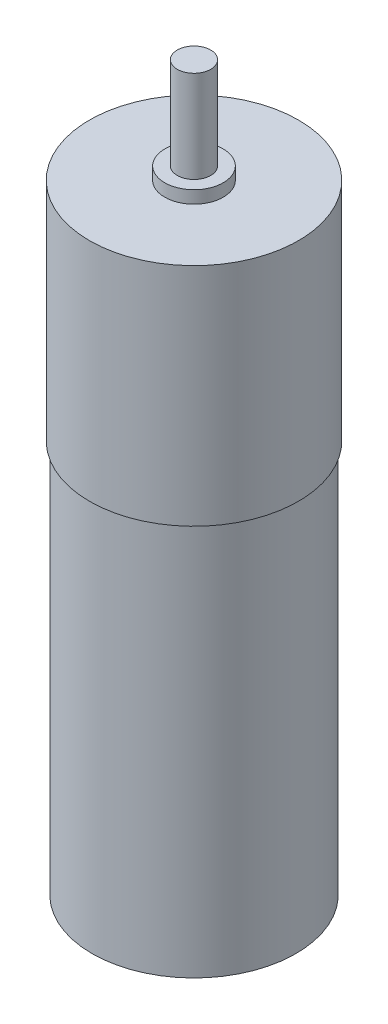
ISO-10303-21;
HEADER;
FILE_DESCRIPTION(('STEP AP214'),'2;1');
FILE_NAME('part.step','',(''),(''),'','','');
FILE_SCHEMA(('AUTOMOTIVE_DESIGN { 1 0 10303 214 1 1 1 1 }'));
ENDSEC;
DATA;
#1=APPLICATION_CONTEXT('core data for automotive mechanical design processes');
#2=APPLICATION_PROTOCOL_DEFINITION('international standard','automotive_design',2000,#1);
#3=PRODUCT_CONTEXT('',#1,'mechanical');
#4=PRODUCT('Part','Part','',(#3));
#5=PRODUCT_RELATED_PRODUCT_CATEGORY('part','',(#4));
#6=PRODUCT_DEFINITION_FORMATION('','',#4);
#7=PRODUCT_DEFINITION_CONTEXT('part definition',#1,'design');
#8=PRODUCT_DEFINITION('design','',#6,#7);
#9=PRODUCT_DEFINITION_SHAPE('','',#8);
#10=(LENGTH_UNIT() NAMED_UNIT(*) SI_UNIT(.MILLI.,.METRE.));
#11=(NAMED_UNIT(*) PLANE_ANGLE_UNIT() SI_UNIT($,.RADIAN.));
#12=(NAMED_UNIT(*) SI_UNIT($,.STERADIAN.) SOLID_ANGLE_UNIT());
#13=UNCERTAINTY_MEASURE_WITH_UNIT(LENGTH_MEASURE(1.E-05),#10,'distance_accuracy_value','');
#14=(GEOMETRIC_REPRESENTATION_CONTEXT(3) GLOBAL_UNCERTAINTY_ASSIGNED_CONTEXT((#13)) GLOBAL_UNIT_ASSIGNED_CONTEXT((#10,
#11,#12)) REPRESENTATION_CONTEXT('',''));
#15=CARTESIAN_POINT('',(0.,0.,0.));
#16=DIRECTION('',(0.,0.,1.));
#17=DIRECTION('',(1.,0.,0.));
#18=AXIS2_PLACEMENT_3D('',#15,#16,#17);
#19=CARTESIAN_POINT('',(0.,23.5,0.));
#20=DIRECTION('',(0.,-1.,0.));
#21=DIRECTION('',(0.,0.,-1.));
#22=AXIS2_PLACEMENT_3D('',#19,#20,#21);
#23=CYLINDRICAL_SURFACE('',#22,12.2);
#24=CARTESIAN_POINT('',(0.,23.5,0.));
#25=DIRECTION('',(0.,1.,0.));
#26=DIRECTION('',(0.,0.,1.));
#27=AXIS2_PLACEMENT_3D('',#24,#25,#26);
#28=CIRCLE('',#27,12.2);
#29=CARTESIAN_POINT('',(0.,23.5,12.2));
#30=VERTEX_POINT('',#29);
#31=EDGE_CURVE('E45',#30,#30,#28,.T.);
#32=ORIENTED_EDGE('',*,*,#31,.F.);
#33=EDGE_LOOP('',(#32));
#34=FACE_BOUND('',#33,.T.);
#35=CARTESIAN_POINT('',(0.,-23.5,0.));
#36=DIRECTION('',(0.,1.,0.));
#37=DIRECTION('',(0.,0.,1.));
#38=AXIS2_PLACEMENT_3D('',#35,#36,#37);
#39=CIRCLE('',#38,12.2);
#40=CARTESIAN_POINT('',(0.,-23.5,12.2));
#41=VERTEX_POINT('',#40);
#42=EDGE_CURVE('E36',#41,#41,#39,.T.);
#43=ORIENTED_EDGE('',*,*,#42,.T.);
#44=EDGE_LOOP('',(#43));
#45=FACE_BOUND('',#44,.T.);
#46=ADVANCED_FACE('F33',(#34,#45),#23,.T.);
#47=CARTESIAN_POINT('',(0.,-23.5,0.));
#48=DIRECTION('',(0.,1.,0.));
#49=DIRECTION('',(0.,0.,1.));
#50=AXIS2_PLACEMENT_3D('',#47,#48,#49);
#51=PLANE('',#50);
#52=ORIENTED_EDGE('',*,*,#42,.F.);
#53=EDGE_LOOP('',(#52));
#54=FACE_BOUND('',#53,.T.);
#55=ADVANCED_FACE('F65',(#54),#51,.F.);
#56=CARTESIAN_POINT('',(0.,50.5,0.));
#57=DIRECTION('',(0.,-1.,0.));
#58=DIRECTION('',(0.,0.,-1.));
#59=AXIS2_PLACEMENT_3D('',#56,#57,#58);
#60=CYLINDRICAL_SURFACE('',#59,12.5);
#61=CARTESIAN_POINT('',(0.,50.5,0.));
#62=DIRECTION('',(0.,1.,0.));
#63=DIRECTION('',(0.,0.,1.));
#64=AXIS2_PLACEMENT_3D('',#61,#62,#63);
#65=CIRCLE('',#64,12.5);
#66=CARTESIAN_POINT('',(0.,50.5,12.5));
#67=VERTEX_POINT('',#66);
#68=EDGE_CURVE('E54',#67,#67,#65,.T.);
#69=ORIENTED_EDGE('',*,*,#68,.F.);
#70=EDGE_LOOP('',(#69));
#71=FACE_BOUND('',#70,.T.);
#72=CARTESIAN_POINT('',(0.,23.5,0.));
#73=DIRECTION('',(0.,1.,0.));
#74=DIRECTION('',(0.,0.,1.));
#75=AXIS2_PLACEMENT_3D('',#72,#73,#74);
#76=CIRCLE('',#75,12.5);
#77=CARTESIAN_POINT('',(0.,23.5,12.5));
#78=VERTEX_POINT('',#77);
#79=EDGE_CURVE('E52',#78,#78,#76,.T.);
#80=ORIENTED_EDGE('',*,*,#79,.T.);
#81=EDGE_LOOP('',(#80));
#82=FACE_BOUND('',#81,.T.);
#83=ADVANCED_FACE('F67',(#71,#82),#60,.T.);
#84=CARTESIAN_POINT('',(0.,50.5,0.));
#85=DIRECTION('',(0.,1.,0.));
#86=DIRECTION('',(0.,0.,1.));
#87=AXIS2_PLACEMENT_3D('',#84,#85,#86);
#88=PLANE('',#87);
#89=CARTESIAN_POINT('',(0.,50.5,0.));
#90=DIRECTION('',(0.,1.,0.));
#91=DIRECTION('',(0.,0.,1.));
#92=AXIS2_PLACEMENT_3D('',#89,#90,#91);
#93=CIRCLE('',#92,3.5);
#94=CARTESIAN_POINT('',(0.,50.5,3.5));
#95=VERTEX_POINT('',#94);
#96=EDGE_CURVE('E40',#95,#95,#93,.T.);
#97=ORIENTED_EDGE('',*,*,#96,.F.);
#98=EDGE_LOOP('',(#97));
#99=FACE_BOUND('',#98,.T.);
#100=ORIENTED_EDGE('',*,*,#68,.T.);
#101=EDGE_LOOP('',(#100));
#102=FACE_BOUND('',#101,.T.);
#103=ADVANCED_FACE('F72',(#99,#102),#88,.T.);
#104=CARTESIAN_POINT('',(0.,23.5,0.));
#105=DIRECTION('',(0.,1.,0.));
#106=DIRECTION('',(0.,0.,1.));
#107=AXIS2_PLACEMENT_3D('',#104,#105,#106);
#108=PLANE('',#107);
#109=ORIENTED_EDGE('',*,*,#31,.T.);
#110=EDGE_LOOP('',(#109));
#111=FACE_BOUND('',#110,.T.);
#112=ORIENTED_EDGE('',*,*,#79,.F.);
#113=EDGE_LOOP('',(#112));
#114=FACE_BOUND('',#113,.T.);
#115=ADVANCED_FACE('F77',(#111,#114),#108,.F.);
#116=CARTESIAN_POINT('',(0.,52.,0.));
#117=DIRECTION('',(0.,-1.,0.));
#118=DIRECTION('',(0.,0.,-1.));
#119=AXIS2_PLACEMENT_3D('',#116,#117,#118);
#120=CYLINDRICAL_SURFACE('',#119,3.5);
#121=CARTESIAN_POINT('',(0.,52.,0.));
#122=DIRECTION('',(0.,1.,0.));
#123=DIRECTION('',(0.,0.,1.));
#124=AXIS2_PLACEMENT_3D('',#121,#122,#123);
#125=CIRCLE('',#124,3.5);
#126=CARTESIAN_POINT('',(0.,52.,3.5));
#127=VERTEX_POINT('',#126);
#128=EDGE_CURVE('E50',#127,#127,#125,.T.);
#129=ORIENTED_EDGE('',*,*,#128,.F.);
#130=EDGE_LOOP('',(#129));
#131=FACE_BOUND('',#130,.T.);
#132=ORIENTED_EDGE('',*,*,#96,.T.);
#133=EDGE_LOOP('',(#132));
#134=FACE_BOUND('',#133,.T.);
#135=ADVANCED_FACE('F80',(#131,#134),#120,.T.);
#136=CARTESIAN_POINT('',(0.,52.,0.));
#137=DIRECTION('',(0.,1.,0.));
#138=DIRECTION('',(0.,0.,1.));
#139=AXIS2_PLACEMENT_3D('',#136,#137,#138);
#140=PLANE('',#139);
#141=CARTESIAN_POINT('',(0.,52.,0.));
#142=DIRECTION('',(0.,1.,0.));
#143=DIRECTION('',(0.,0.,1.));
#144=AXIS2_PLACEMENT_3D('',#141,#142,#143);
#145=CIRCLE('',#144,2.);
#146=CARTESIAN_POINT('',(0.,52.,2.));
#147=VERTEX_POINT('',#146);
#148=EDGE_CURVE('E10',#147,#147,#145,.T.);
#149=ORIENTED_EDGE('',*,*,#148,.F.);
#150=EDGE_LOOP('',(#149));
#151=FACE_BOUND('',#150,.T.);
#152=ORIENTED_EDGE('',*,*,#128,.T.);
#153=EDGE_LOOP('',(#152));
#154=FACE_BOUND('',#153,.T.);
#155=ADVANCED_FACE('F86',(#151,#154),#140,.T.);
#156=CARTESIAN_POINT('',(0.,63.,0.));
#157=DIRECTION('',(0.,-1.,0.));
#158=DIRECTION('',(0.,0.,-1.));
#159=AXIS2_PLACEMENT_3D('',#156,#157,#158);
#160=CYLINDRICAL_SURFACE('',#159,2.);
#161=CARTESIAN_POINT('',(0.,63.,0.));
#162=DIRECTION('',(0.,1.,0.));
#163=DIRECTION('',(0.,0.,1.));
#164=AXIS2_PLACEMENT_3D('',#161,#162,#163);
#165=CIRCLE('',#164,2.);
#166=CARTESIAN_POINT('',(0.,63.,2.));
#167=VERTEX_POINT('',#166);
#168=EDGE_CURVE('E49',#167,#167,#165,.T.);
#169=ORIENTED_EDGE('',*,*,#168,.F.);
#170=EDGE_LOOP('',(#169));
#171=FACE_BOUND('',#170,.T.);
#172=ORIENTED_EDGE('',*,*,#148,.T.);
#173=EDGE_LOOP('',(#172));
#174=FACE_BOUND('',#173,.T.);
#175=ADVANCED_FACE('F90',(#171,#174),#160,.T.);
#176=CARTESIAN_POINT('',(0.,63.,0.));
#177=DIRECTION('',(0.,1.,0.));
#178=DIRECTION('',(0.,0.,1.));
#179=AXIS2_PLACEMENT_3D('',#176,#177,#178);
#180=PLANE('',#179);
#181=ORIENTED_EDGE('',*,*,#168,.T.);
#182=EDGE_LOOP('',(#181));
#183=FACE_BOUND('',#182,.T.);
#184=ADVANCED_FACE('F94',(#183),#180,.T.);
#185=CLOSED_SHELL('',(#46,#55,#83,#103,#115,#135,#155,#175,#184));
#186=MANIFOLD_SOLID_BREP('B2',#185);
#187=ADVANCED_BREP_SHAPE_REPRESENTATION('',(#18,#186),#14);
#188=SHAPE_DEFINITION_REPRESENTATION(#9,#187);
ENDSEC;
END-ISO-10303-21;
